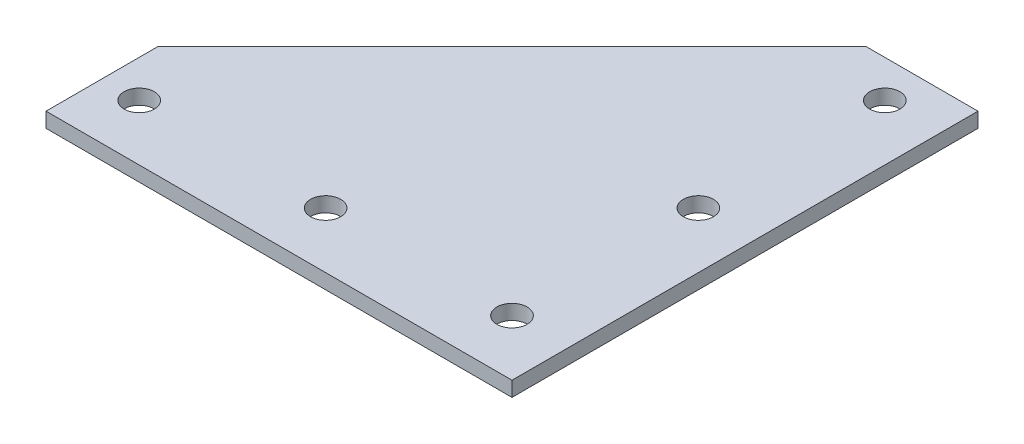
ISO-10303-21;
HEADER;
FILE_DESCRIPTION(('STEP AP214'),'2;1');
FILE_NAME('part.step','',(''),(''),'','','');
FILE_SCHEMA(('AUTOMOTIVE_DESIGN { 1 0 10303 214 1 1 1 1 }'));
ENDSEC;
DATA;
#1=APPLICATION_CONTEXT('core data for automotive mechanical design processes');
#2=APPLICATION_PROTOCOL_DEFINITION('international standard','automotive_design',2000,#1);
#3=PRODUCT_CONTEXT('',#1,'mechanical');
#4=PRODUCT('Part','Part','',(#3));
#5=PRODUCT_RELATED_PRODUCT_CATEGORY('part','',(#4));
#6=PRODUCT_DEFINITION_FORMATION('','',#4);
#7=PRODUCT_DEFINITION_CONTEXT('part definition',#1,'design');
#8=PRODUCT_DEFINITION('design','',#6,#7);
#9=PRODUCT_DEFINITION_SHAPE('','',#8);
#10=(LENGTH_UNIT() NAMED_UNIT(*) SI_UNIT(.MILLI.,.METRE.));
#11=(NAMED_UNIT(*) PLANE_ANGLE_UNIT() SI_UNIT($,.RADIAN.));
#12=(NAMED_UNIT(*) SI_UNIT($,.STERADIAN.) SOLID_ANGLE_UNIT());
#13=UNCERTAINTY_MEASURE_WITH_UNIT(LENGTH_MEASURE(1.E-05),#10,'distance_accuracy_value','');
#14=(GEOMETRIC_REPRESENTATION_CONTEXT(3) GLOBAL_UNCERTAINTY_ASSIGNED_CONTEXT((#13)) GLOBAL_UNIT_ASSIGNED_CONTEXT((#10,
#11,#12)) REPRESENTATION_CONTEXT('',''));
#15=CARTESIAN_POINT('',(0.,0.,0.));
#16=DIRECTION('',(0.,0.,1.));
#17=DIRECTION('',(1.,0.,0.));
#18=AXIS2_PLACEMENT_3D('',#15,#16,#17);
#19=CARTESIAN_POINT('',(0.,4.,0.));
#20=DIRECTION('',(0.,-1.,0.));
#21=DIRECTION('',(0.,0.,-1.));
#22=AXIS2_PLACEMENT_3D('',#19,#20,#21);
#23=PLANE('',#22);
#24=DIRECTION('',(0.,0.,-1.));
#25=VECTOR('',#24,1.);
#26=CARTESIAN_POINT('',(15.,4.,15.));
#27=LINE('',#26,#25);
#28=CARTESIAN_POINT('',(15.,4.,15.));
#29=VERTEX_POINT('',#28);
#30=CARTESIAN_POINT('',(15.,4.,-110.));
#31=VERTEX_POINT('',#30);
#32=EDGE_CURVE('E137',#29,#31,#27,.T.);
#33=ORIENTED_EDGE('',*,*,#32,.T.);
#34=DIRECTION('',(-1.,0.,0.));
#35=VECTOR('',#34,1.);
#36=CARTESIAN_POINT('',(-15.,4.,-110.));
#37=LINE('',#36,#35);
#38=CARTESIAN_POINT('',(-15.,4.,-110.));
#39=VERTEX_POINT('',#38);
#40=EDGE_CURVE('E95',#31,#39,#37,.T.);
#41=ORIENTED_EDGE('',*,*,#40,.T.);
#42=DIRECTION('',(-0.707106781186548,0.,0.707106781186548));
#43=VECTOR('',#42,1.);
#44=CARTESIAN_POINT('',(-110.,4.,-15.));
#45=LINE('',#44,#43);
#46=CARTESIAN_POINT('',(-110.,4.,-15.));
#47=VERTEX_POINT('',#46);
#48=EDGE_CURVE('E99',#39,#47,#45,.T.);
#49=ORIENTED_EDGE('',*,*,#48,.T.);
#50=DIRECTION('',(0.,0.,1.));
#51=VECTOR('',#50,1.);
#52=CARTESIAN_POINT('',(-110.,4.,15.));
#53=LINE('',#52,#51);
#54=CARTESIAN_POINT('',(-110.,4.,15.));
#55=VERTEX_POINT('',#54);
#56=EDGE_CURVE('E103',#47,#55,#53,.T.);
#57=ORIENTED_EDGE('',*,*,#56,.T.);
#58=DIRECTION('',(1.,0.,0.));
#59=VECTOR('',#58,1.);
#60=CARTESIAN_POINT('',(15.,4.,15.));
#61=LINE('',#60,#59);
#62=EDGE_CURVE('E61',#55,#29,#61,.T.);
#63=ORIENTED_EDGE('',*,*,#62,.T.);
#64=EDGE_LOOP('',(#33,#41,#49,#57,#63));
#65=FACE_BOUND('',#64,.T.);
#66=CARTESIAN_POINT('',(-100.,4.,0.));
#67=DIRECTION('',(0.,1.,0.));
#68=DIRECTION('',(0.,0.,1.));
#69=AXIS2_PLACEMENT_3D('',#66,#67,#68);
#70=CIRCLE('',#69,4.05);
#71=CARTESIAN_POINT('',(-100.,4.,4.05000000000001));
#72=VERTEX_POINT('',#71);
#73=EDGE_CURVE('E128',#72,#72,#70,.T.);
#74=ORIENTED_EDGE('',*,*,#73,.F.);
#75=EDGE_LOOP('',(#74));
#76=FACE_BOUND('',#75,.T.);
#77=CARTESIAN_POINT('',(-50.,4.,0.));
#78=DIRECTION('',(0.,1.,0.));
#79=DIRECTION('',(0.,0.,1.));
#80=AXIS2_PLACEMENT_3D('',#77,#78,#79);
#81=CIRCLE('',#80,4.05000000000001);
#82=CARTESIAN_POINT('',(-50.,4.,4.05000000000002));
#83=VERTEX_POINT('',#82);
#84=EDGE_CURVE('E215',#83,#83,#81,.T.);
#85=ORIENTED_EDGE('',*,*,#84,.F.);
#86=EDGE_LOOP('',(#85));
#87=FACE_BOUND('',#86,.T.);
#88=CARTESIAN_POINT('',(0.,4.,0.));
#89=DIRECTION('',(0.,1.,0.));
#90=DIRECTION('',(0.,0.,1.));
#91=AXIS2_PLACEMENT_3D('',#88,#89,#90);
#92=CIRCLE('',#91,4.05);
#93=CARTESIAN_POINT('',(0.,4.,4.05));
#94=VERTEX_POINT('',#93);
#95=EDGE_CURVE('E207',#94,#94,#92,.T.);
#96=ORIENTED_EDGE('',*,*,#95,.F.);
#97=EDGE_LOOP('',(#96));
#98=FACE_BOUND('',#97,.T.);
#99=CARTESIAN_POINT('',(0.,4.,-100.));
#100=DIRECTION('',(0.,1.,0.));
#101=DIRECTION('',(0.,0.,1.));
#102=AXIS2_PLACEMENT_3D('',#99,#100,#101);
#103=CIRCLE('',#102,4.04999999999999);
#104=CARTESIAN_POINT('',(0.,4.,-95.95));
#105=VERTEX_POINT('',#104);
#106=EDGE_CURVE('E199',#105,#105,#103,.T.);
#107=ORIENTED_EDGE('',*,*,#106,.F.);
#108=EDGE_LOOP('',(#107));
#109=FACE_BOUND('',#108,.T.);
#110=CARTESIAN_POINT('',(0.,4.,-50.));
#111=DIRECTION('',(0.,1.,0.));
#112=DIRECTION('',(0.,0.,1.));
#113=AXIS2_PLACEMENT_3D('',#110,#111,#112);
#114=CIRCLE('',#113,4.04999999999999);
#115=CARTESIAN_POINT('',(0.,4.,-45.95));
#116=VERTEX_POINT('',#115);
#117=EDGE_CURVE('E188',#116,#116,#114,.T.);
#118=ORIENTED_EDGE('',*,*,#117,.F.);
#119=EDGE_LOOP('',(#118));
#120=FACE_BOUND('',#119,.T.);
#121=ADVANCED_FACE('F43',(#65,#76,#87,#98,#109,#120),#23,.F.);
#122=CARTESIAN_POINT('',(0.,0.,0.));
#123=DIRECTION('',(0.,-1.,0.));
#124=DIRECTION('',(0.,0.,-1.));
#125=AXIS2_PLACEMENT_3D('',#122,#123,#124);
#126=PLANE('',#125);
#127=CARTESIAN_POINT('',(0.,0.,-100.));
#128=DIRECTION('',(0.,1.,0.));
#129=DIRECTION('',(0.,0.,1.));
#130=AXIS2_PLACEMENT_3D('',#127,#128,#129);
#131=CIRCLE('',#130,4.04999999999999);
#132=CARTESIAN_POINT('',(0.,0.,-95.95));
#133=VERTEX_POINT('',#132);
#134=EDGE_CURVE('E196',#133,#133,#131,.T.);
#135=ORIENTED_EDGE('',*,*,#134,.T.);
#136=EDGE_LOOP('',(#135));
#137=FACE_BOUND('',#136,.T.);
#138=CARTESIAN_POINT('',(-50.,0.,0.));
#139=DIRECTION('',(0.,1.,0.));
#140=DIRECTION('',(0.,0.,1.));
#141=AXIS2_PLACEMENT_3D('',#138,#139,#140);
#142=CIRCLE('',#141,4.05000000000001);
#143=CARTESIAN_POINT('',(-50.,0.,4.05000000000002));
#144=VERTEX_POINT('',#143);
#145=EDGE_CURVE('E211',#144,#144,#142,.T.);
#146=ORIENTED_EDGE('',*,*,#145,.T.);
#147=EDGE_LOOP('',(#146));
#148=FACE_BOUND('',#147,.T.);
#149=DIRECTION('',(0.,0.,-1.));
#150=VECTOR('',#149,1.);
#151=CARTESIAN_POINT('',(15.,0.,15.));
#152=LINE('',#151,#150);
#153=CARTESIAN_POINT('',(15.,0.,15.));
#154=VERTEX_POINT('',#153);
#155=CARTESIAN_POINT('',(15.,0.,-110.));
#156=VERTEX_POINT('',#155);
#157=EDGE_CURVE('E123',#154,#156,#152,.T.);
#158=ORIENTED_EDGE('',*,*,#157,.F.);
#159=DIRECTION('',(1.,0.,0.));
#160=VECTOR('',#159,1.);
#161=CARTESIAN_POINT('',(15.,0.,15.));
#162=LINE('',#161,#160);
#163=CARTESIAN_POINT('',(-110.,0.,15.));
#164=VERTEX_POINT('',#163);
#165=EDGE_CURVE('E87',#164,#154,#162,.T.);
#166=ORIENTED_EDGE('',*,*,#165,.F.);
#167=DIRECTION('',(0.,0.,1.));
#168=VECTOR('',#167,1.);
#169=CARTESIAN_POINT('',(-110.,0.,15.));
#170=LINE('',#169,#168);
#171=CARTESIAN_POINT('',(-110.,0.,-15.));
#172=VERTEX_POINT('',#171);
#173=EDGE_CURVE('E81',#172,#164,#170,.T.);
#174=ORIENTED_EDGE('',*,*,#173,.F.);
#175=DIRECTION('',(-0.707106781186548,0.,0.707106781186548));
#176=VECTOR('',#175,1.);
#177=CARTESIAN_POINT('',(-110.,0.,-15.));
#178=LINE('',#177,#176);
#179=CARTESIAN_POINT('',(-15.,0.,-110.));
#180=VERTEX_POINT('',#179);
#181=EDGE_CURVE('E111',#180,#172,#178,.T.);
#182=ORIENTED_EDGE('',*,*,#181,.F.);
#183=DIRECTION('',(-1.,0.,0.));
#184=VECTOR('',#183,1.);
#185=CARTESIAN_POINT('',(-15.,0.,-110.));
#186=LINE('',#185,#184);
#187=EDGE_CURVE('E127',#156,#180,#186,.T.);
#188=ORIENTED_EDGE('',*,*,#187,.F.);
#189=EDGE_LOOP('',(#158,#166,#174,#182,#188));
#190=FACE_BOUND('',#189,.T.);
#191=CARTESIAN_POINT('',(-100.,0.,0.));
#192=DIRECTION('',(0.,1.,0.));
#193=DIRECTION('',(0.,0.,1.));
#194=AXIS2_PLACEMENT_3D('',#191,#192,#193);
#195=CIRCLE('',#194,4.05);
#196=CARTESIAN_POINT('',(-100.,0.,4.05000000000001));
#197=VERTEX_POINT('',#196);
#198=EDGE_CURVE('E219',#197,#197,#195,.T.);
#199=ORIENTED_EDGE('',*,*,#198,.T.);
#200=EDGE_LOOP('',(#199));
#201=FACE_BOUND('',#200,.T.);
#202=CARTESIAN_POINT('',(0.,0.,0.));
#203=DIRECTION('',(0.,1.,0.));
#204=DIRECTION('',(0.,0.,1.));
#205=AXIS2_PLACEMENT_3D('',#202,#203,#204);
#206=CIRCLE('',#205,4.05);
#207=CARTESIAN_POINT('',(0.,0.,4.05));
#208=VERTEX_POINT('',#207);
#209=EDGE_CURVE('E203',#208,#208,#206,.T.);
#210=ORIENTED_EDGE('',*,*,#209,.T.);
#211=EDGE_LOOP('',(#210));
#212=FACE_BOUND('',#211,.T.);
#213=CARTESIAN_POINT('',(0.,0.,-50.));
#214=DIRECTION('',(0.,1.,0.));
#215=DIRECTION('',(0.,0.,1.));
#216=AXIS2_PLACEMENT_3D('',#213,#214,#215);
#217=CIRCLE('',#216,4.04999999999999);
#218=CARTESIAN_POINT('',(0.,0.,-45.95));
#219=VERTEX_POINT('',#218);
#220=EDGE_CURVE('E191',#219,#219,#217,.T.);
#221=ORIENTED_EDGE('',*,*,#220,.T.);
#222=EDGE_LOOP('',(#221));
#223=FACE_BOUND('',#222,.T.);
#224=ADVANCED_FACE('F144',(#137,#148,#190,#201,#212,#223),#126,.T.);
#225=CARTESIAN_POINT('',(15.,4.,15.));
#226=DIRECTION('',(-1.,0.,0.));
#227=DIRECTION('',(0.,0.,1.));
#228=AXIS2_PLACEMENT_3D('',#225,#226,#227);
#229=PLANE('',#228);
#230=ORIENTED_EDGE('',*,*,#157,.T.);
#231=DIRECTION('',(0.,-1.,0.));
#232=VECTOR('',#231,1.);
#233=CARTESIAN_POINT('',(15.,4.,-110.));
#234=LINE('',#233,#232);
#235=EDGE_CURVE('E11',#31,#156,#234,.T.);
#236=ORIENTED_EDGE('',*,*,#235,.F.);
#237=ORIENTED_EDGE('',*,*,#32,.F.);
#238=DIRECTION('',(0.,-1.,0.));
#239=VECTOR('',#238,1.);
#240=CARTESIAN_POINT('',(15.,4.,15.));
#241=LINE('',#240,#239);
#242=EDGE_CURVE('E119',#29,#154,#241,.T.);
#243=ORIENTED_EDGE('',*,*,#242,.T.);
#244=EDGE_LOOP('',(#230,#236,#237,#243));
#245=FACE_BOUND('',#244,.T.);
#246=ADVANCED_FACE('F45',(#245),#229,.F.);
#247=CARTESIAN_POINT('',(-15.,4.,-110.));
#248=DIRECTION('',(0.,0.,1.));
#249=DIRECTION('',(1.,0.,0.));
#250=AXIS2_PLACEMENT_3D('',#247,#248,#249);
#251=PLANE('',#250);
#252=ORIENTED_EDGE('',*,*,#187,.T.);
#253=DIRECTION('',(0.,-1.,0.));
#254=VECTOR('',#253,1.);
#255=CARTESIAN_POINT('',(-15.,4.,-110.));
#256=LINE('',#255,#254);
#257=EDGE_CURVE('E53',#39,#180,#256,.T.);
#258=ORIENTED_EDGE('',*,*,#257,.F.);
#259=ORIENTED_EDGE('',*,*,#40,.F.);
#260=ORIENTED_EDGE('',*,*,#235,.T.);
#261=EDGE_LOOP('',(#252,#258,#259,#260));
#262=FACE_BOUND('',#261,.T.);
#263=ADVANCED_FACE('F287',(#262),#251,.F.);
#264=CARTESIAN_POINT('',(-110.,4.,-15.));
#265=DIRECTION('',(0.707106781186547,0.,0.707106781186547));
#266=DIRECTION('',(0.707106781186548,0.,-0.707106781186548));
#267=AXIS2_PLACEMENT_3D('',#264,#265,#266);
#268=PLANE('',#267);
#269=ORIENTED_EDGE('',*,*,#181,.T.);
#270=DIRECTION('',(0.,-1.,0.));
#271=VECTOR('',#270,1.);
#272=CARTESIAN_POINT('',(-110.,4.,-15.));
#273=LINE('',#272,#271);
#274=EDGE_CURVE('E108',#47,#172,#273,.T.);
#275=ORIENTED_EDGE('',*,*,#274,.F.);
#276=ORIENTED_EDGE('',*,*,#48,.F.);
#277=ORIENTED_EDGE('',*,*,#257,.T.);
#278=EDGE_LOOP('',(#269,#275,#276,#277));
#279=FACE_BOUND('',#278,.T.);
#280=ADVANCED_FACE('F109',(#279),#268,.F.);
#281=CARTESIAN_POINT('',(-110.,4.,15.));
#282=DIRECTION('',(1.,0.,0.));
#283=DIRECTION('',(0.,0.,-1.));
#284=AXIS2_PLACEMENT_3D('',#281,#282,#283);
#285=PLANE('',#284);
#286=ORIENTED_EDGE('',*,*,#173,.T.);
#287=DIRECTION('',(0.,-1.,0.));
#288=VECTOR('',#287,1.);
#289=CARTESIAN_POINT('',(-110.,4.,15.));
#290=LINE('',#289,#288);
#291=EDGE_CURVE('E113',#55,#164,#290,.T.);
#292=ORIENTED_EDGE('',*,*,#291,.F.);
#293=ORIENTED_EDGE('',*,*,#56,.F.);
#294=ORIENTED_EDGE('',*,*,#274,.T.);
#295=EDGE_LOOP('',(#286,#292,#293,#294));
#296=FACE_BOUND('',#295,.T.);
#297=ADVANCED_FACE('F115',(#296),#285,.F.);
#298=CARTESIAN_POINT('',(15.,4.,15.));
#299=DIRECTION('',(0.,0.,-1.));
#300=DIRECTION('',(-1.,0.,0.));
#301=AXIS2_PLACEMENT_3D('',#298,#299,#300);
#302=PLANE('',#301);
#303=ORIENTED_EDGE('',*,*,#165,.T.);
#304=ORIENTED_EDGE('',*,*,#242,.F.);
#305=ORIENTED_EDGE('',*,*,#62,.F.);
#306=ORIENTED_EDGE('',*,*,#291,.T.);
#307=EDGE_LOOP('',(#303,#304,#305,#306));
#308=FACE_BOUND('',#307,.T.);
#309=ADVANCED_FACE('F149',(#308),#302,.F.);
#310=CARTESIAN_POINT('',(-100.,4.,0.));
#311=DIRECTION('',(0.,-1.,0.));
#312=DIRECTION('',(0.,0.,-1.));
#313=AXIS2_PLACEMENT_3D('',#310,#311,#312);
#314=CYLINDRICAL_SURFACE('',#313,4.05);
#315=ORIENTED_EDGE('',*,*,#73,.T.);
#316=EDGE_LOOP('',(#315));
#317=FACE_BOUND('',#316,.T.);
#318=ORIENTED_EDGE('',*,*,#198,.F.);
#319=EDGE_LOOP('',(#318));
#320=FACE_BOUND('',#319,.T.);
#321=ADVANCED_FACE('F151',(#317,#320),#314,.F.);
#322=CARTESIAN_POINT('',(-50.,4.,0.));
#323=DIRECTION('',(0.,-1.,0.));
#324=DIRECTION('',(0.,0.,-1.));
#325=AXIS2_PLACEMENT_3D('',#322,#323,#324);
#326=CYLINDRICAL_SURFACE('',#325,4.05000000000001);
#327=ORIENTED_EDGE('',*,*,#84,.T.);
#328=EDGE_LOOP('',(#327));
#329=FACE_BOUND('',#328,.T.);
#330=ORIENTED_EDGE('',*,*,#145,.F.);
#331=EDGE_LOOP('',(#330));
#332=FACE_BOUND('',#331,.T.);
#333=ADVANCED_FACE('F157',(#329,#332),#326,.F.);
#334=CARTESIAN_POINT('',(0.,4.,0.));
#335=DIRECTION('',(0.,-1.,0.));
#336=DIRECTION('',(0.,0.,-1.));
#337=AXIS2_PLACEMENT_3D('',#334,#335,#336);
#338=CYLINDRICAL_SURFACE('',#337,4.05);
#339=ORIENTED_EDGE('',*,*,#95,.T.);
#340=EDGE_LOOP('',(#339));
#341=FACE_BOUND('',#340,.T.);
#342=ORIENTED_EDGE('',*,*,#209,.F.);
#343=EDGE_LOOP('',(#342));
#344=FACE_BOUND('',#343,.T.);
#345=ADVANCED_FACE('F171',(#341,#344),#338,.F.);
#346=CARTESIAN_POINT('',(0.,4.,-100.));
#347=DIRECTION('',(0.,-1.,0.));
#348=DIRECTION('',(0.,0.,-1.));
#349=AXIS2_PLACEMENT_3D('',#346,#347,#348);
#350=CYLINDRICAL_SURFACE('',#349,4.04999999999999);
#351=ORIENTED_EDGE('',*,*,#106,.T.);
#352=EDGE_LOOP('',(#351));
#353=FACE_BOUND('',#352,.T.);
#354=ORIENTED_EDGE('',*,*,#134,.F.);
#355=EDGE_LOOP('',(#354));
#356=FACE_BOUND('',#355,.T.);
#357=ADVANCED_FACE('F175',(#353,#356),#350,.F.);
#358=CARTESIAN_POINT('',(0.,4.,-50.));
#359=DIRECTION('',(0.,-1.,0.));
#360=DIRECTION('',(0.,0.,-1.));
#361=AXIS2_PLACEMENT_3D('',#358,#359,#360);
#362=CYLINDRICAL_SURFACE('',#361,4.04999999999999);
#363=ORIENTED_EDGE('',*,*,#117,.T.);
#364=EDGE_LOOP('',(#363));
#365=FACE_BOUND('',#364,.T.);
#366=ORIENTED_EDGE('',*,*,#220,.F.);
#367=EDGE_LOOP('',(#366));
#368=FACE_BOUND('',#367,.T.);
#369=ADVANCED_FACE('F179',(#365,#368),#362,.F.);
#370=CLOSED_SHELL('',(#121,#224,#246,#263,#280,#297,#309,#321,#333,#345,#357,#369));
#371=MANIFOLD_SOLID_BREP('B2',#370);
#372=ADVANCED_BREP_SHAPE_REPRESENTATION('',(#18,#371),#14);
#373=SHAPE_DEFINITION_REPRESENTATION(#9,#372);
ENDSEC;
END-ISO-10303-21;
